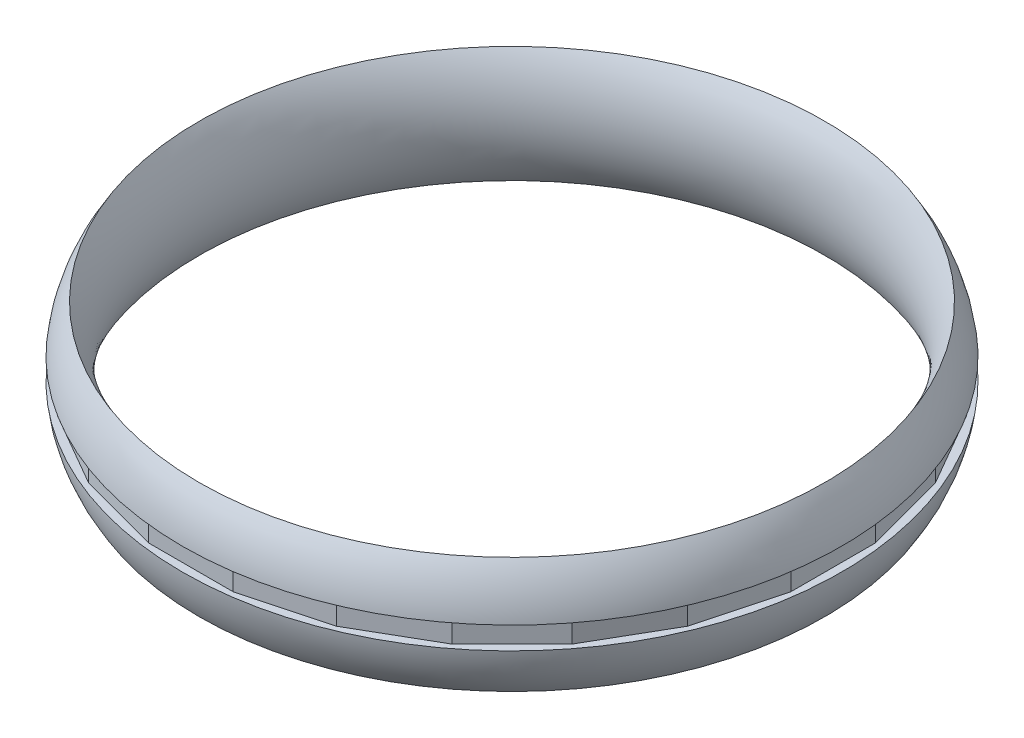
ISO-10303-21;
HEADER;
FILE_DESCRIPTION(('STEP AP214'),'2;1');
FILE_NAME('part.step','',(''),(''),'','','');
FILE_SCHEMA(('AUTOMOTIVE_DESIGN { 1 0 10303 214 1 1 1 1 }'));
ENDSEC;
DATA;
#1=APPLICATION_CONTEXT('core data for automotive mechanical design processes');
#2=APPLICATION_PROTOCOL_DEFINITION('international standard','automotive_design',2000,#1);
#3=PRODUCT_CONTEXT('',#1,'mechanical');
#4=PRODUCT('Part','Part','',(#3));
#5=PRODUCT_RELATED_PRODUCT_CATEGORY('part','',(#4));
#6=PRODUCT_DEFINITION_FORMATION('','',#4);
#7=PRODUCT_DEFINITION_CONTEXT('part definition',#1,'design');
#8=PRODUCT_DEFINITION('design','',#6,#7);
#9=PRODUCT_DEFINITION_SHAPE('','',#8);
#10=(LENGTH_UNIT() NAMED_UNIT(*) SI_UNIT(.MILLI.,.METRE.));
#11=(NAMED_UNIT(*) PLANE_ANGLE_UNIT() SI_UNIT($,.RADIAN.));
#12=(NAMED_UNIT(*) SI_UNIT($,.STERADIAN.) SOLID_ANGLE_UNIT());
#13=UNCERTAINTY_MEASURE_WITH_UNIT(LENGTH_MEASURE(1.E-05),#10,'distance_accuracy_value','');
#14=(GEOMETRIC_REPRESENTATION_CONTEXT(3) GLOBAL_UNCERTAINTY_ASSIGNED_CONTEXT((#13)) GLOBAL_UNIT_ASSIGNED_CONTEXT((#10,
#11,#12)) REPRESENTATION_CONTEXT('',''));
#15=CARTESIAN_POINT('',(0.,0.,0.));
#16=DIRECTION('',(0.,0.,1.));
#17=DIRECTION('',(1.,0.,0.));
#18=AXIS2_PLACEMENT_3D('',#15,#16,#17);
#19=CARTESIAN_POINT('',(0.,0.,0.));
#20=DIRECTION('',(0.,1.,0.));
#21=DIRECTION('',(0.,0.,1.));
#22=AXIS2_PLACEMENT_3D('',#19,#20,#21);
#23=TOROIDAL_SURFACE('',#22,50.,23.8537208837531);
#24=CARTESIAN_POINT('',(0.,-2.5,0.));
#25=DIRECTION('',(0.,-1.,0.));
#26=DIRECTION('',(0.,0.,-1.));
#27=AXIS2_PLACEMENT_3D('',#24,#25,#26);
#28=CIRCLE('',#27,73.7223523285529);
#29=CARTESIAN_POINT('',(0.,-2.5,-73.7223523285529));
#30=VERTEX_POINT('',#29);
#31=EDGE_CURVE('E12',#30,#30,#28,.F.);
#32=ORIENTED_EDGE('',*,*,#31,.F.);
#33=EDGE_LOOP('',(#32));
#34=FACE_BOUND('',#33,.T.);
#35=CARTESIAN_POINT('',(0.,-13.,0.));
#36=DIRECTION('',(0.,1.,0.));
#37=DIRECTION('',(0.,0.,1.));
#38=AXIS2_PLACEMENT_3D('',#35,#36,#37);
#39=CIRCLE('',#38,70.);
#40=CARTESIAN_POINT('',(0.,-13.,70.));
#41=VERTEX_POINT('',#40);
#42=EDGE_CURVE('E395',#41,#41,#39,.T.);
#43=ORIENTED_EDGE('',*,*,#42,.T.);
#44=EDGE_LOOP('',(#43));
#45=FACE_BOUND('',#44,.T.);
#46=ADVANCED_FACE('F44',(#34,#45),#23,.T.);
#47=CARTESIAN_POINT('',(0.,2.5,0.));
#48=DIRECTION('',(0.,1.,0.));
#49=DIRECTION('',(0.,0.,1.));
#50=AXIS2_PLACEMENT_3D('',#47,#48,#49);
#51=CIRCLE('',#50,73.7223523285529);
#52=CARTESIAN_POINT('',(0.,2.5,73.7223523285529));
#53=VERTEX_POINT('',#52);
#54=EDGE_CURVE('E52',#53,#53,#51,.F.);
#55=ORIENTED_EDGE('',*,*,#54,.F.);
#56=EDGE_LOOP('',(#55));
#57=FACE_BOUND('',#56,.T.);
#58=CARTESIAN_POINT('',(0.,13.,0.));
#59=DIRECTION('',(0.,1.,0.));
#60=DIRECTION('',(0.,0.,1.));
#61=AXIS2_PLACEMENT_3D('',#58,#59,#60);
#62=CIRCLE('',#61,70.);
#63=CARTESIAN_POINT('',(0.,13.,70.));
#64=VERTEX_POINT('',#63);
#65=EDGE_CURVE('E391',#64,#64,#62,.T.);
#66=ORIENTED_EDGE('',*,*,#65,.F.);
#67=EDGE_LOOP('',(#66));
#68=FACE_BOUND('',#67,.T.);
#69=ADVANCED_FACE('F46',(#57,#68),#23,.T.);
#70=CARTESIAN_POINT('',(0.,0.,0.));
#71=DIRECTION('',(0.,1.,0.));
#72=DIRECTION('',(0.,0.,1.));
#73=AXIS2_PLACEMENT_3D('',#70,#71,#72);
#74=TOROIDAL_SURFACE('',#73,90.,23.8537208837531);
#75=ORIENTED_EDGE('',*,*,#65,.T.);
#76=EDGE_LOOP('',(#75));
#77=FACE_BOUND('',#76,.T.);
#78=ORIENTED_EDGE('',*,*,#42,.F.);
#79=EDGE_LOOP('',(#78));
#80=FACE_BOUND('',#79,.T.);
#81=ADVANCED_FACE('F402',(#77,#80),#74,.T.);
#82=CARTESIAN_POINT('',(-71.8537208837531,2.5,-73.8537208837531));
#83=DIRECTION('',(1.,0.,0.));
#84=DIRECTION('',(0.,0.,-1.));
#85=AXIS2_PLACEMENT_3D('',#82,#83,#84);
#86=PLANE('',#85);
#87=DIRECTION('',(0.,0.,1.));
#88=VECTOR('',#87,1.);
#89=CARTESIAN_POINT('',(-71.8537208837531,-2.5,-73.8537208837531));
#90=LINE('',#89,#88);
#91=CARTESIAN_POINT('',(-71.8537208837531,-2.5,-9.4597218152932));
#92=VERTEX_POINT('',#91);
#93=CARTESIAN_POINT('',(-71.853720883753,-2.5,9.45972181529429));
#94=VERTEX_POINT('',#93);
#95=EDGE_CURVE('E388',#92,#94,#90,.T.);
#96=ORIENTED_EDGE('',*,*,#95,.T.);
#97=DIRECTION('',(0.,1.,0.));
#98=VECTOR('',#97,1.);
#99=CARTESIAN_POINT('',(-71.8537208837531,2.5,9.45972181529428));
#100=LINE('',#99,#98);
#101=CARTESIAN_POINT('',(-71.853720883753,2.5,9.45972181529429));
#102=VERTEX_POINT('',#101);
#103=EDGE_CURVE('E227',#94,#102,#100,.T.);
#104=ORIENTED_EDGE('',*,*,#103,.T.);
#105=DIRECTION('',(0.,0.,1.));
#106=VECTOR('',#105,1.);
#107=CARTESIAN_POINT('',(-71.8537208837531,2.5,-73.8537208837531));
#108=LINE('',#107,#106);
#109=CARTESIAN_POINT('',(-71.8537208837531,2.5,-9.4597218152932));
#110=VERTEX_POINT('',#109);
#111=EDGE_CURVE('E386',#110,#102,#108,.T.);
#112=ORIENTED_EDGE('',*,*,#111,.F.);
#113=DIRECTION('',(0.,1.,0.));
#114=VECTOR('',#113,1.);
#115=CARTESIAN_POINT('',(-71.8537208837531,2.5,-9.45972181529324));
#116=LINE('',#115,#114);
#117=EDGE_CURVE('E225',#92,#110,#116,.T.);
#118=ORIENTED_EDGE('',*,*,#117,.F.);
#119=EDGE_LOOP('',(#96,#104,#112,#118));
#120=FACE_BOUND('',#119,.T.);
#121=ADVANCED_FACE('F407',(#120),#86,.F.);
#122=CARTESIAN_POINT('',(-75.8537208837531,-2.5,-73.8537208837531));
#123=DIRECTION('',(0.,-1.,0.));
#124=DIRECTION('',(0.,0.,-1.));
#125=AXIS2_PLACEMENT_3D('',#122,#123,#124);
#126=PLANE('',#125);
#127=ORIENTED_EDGE('',*,*,#31,.T.);
#128=EDGE_LOOP('',(#127));
#129=FACE_BOUND('',#128,.T.);
#130=DIRECTION('',(0.258819045102521,0.,0.965925826289068));
#131=VECTOR('',#130,1.);
#132=CARTESIAN_POINT('',(-92.8072561301613,-2.5,-68.7399363224865));
#133=LINE('',#132,#131);
#134=CARTESIAN_POINT('',(-66.9570085494132,-2.5,27.7345010370994));
#135=VERTEX_POINT('',#134);
#136=EDGE_CURVE('E384',#94,#135,#133,.T.);
#137=ORIENTED_EDGE('',*,*,#136,.F.);
#138=ORIENTED_EDGE('',*,*,#95,.F.);
#139=DIRECTION('',(-0.258819045102508,0.,0.965925826289072));
#140=VECTOR('',#139,1.);
#141=CARTESIAN_POINT('',(-45.9946732784378,-2.5,-105.967001313677));
#142=LINE('',#141,#140);
#143=CARTESIAN_POINT('',(-66.9570085494139,-2.5,-27.7345010370975));
#144=VERTEX_POINT('',#143);
#145=EDGE_CURVE('E59',#144,#92,#142,.T.);
#146=ORIENTED_EDGE('',*,*,#145,.F.);
#147=DIRECTION('',(-0.499999999999989,0.,0.866025403784445));
#148=VECTOR('',#147,1.);
#149=CARTESIAN_POINT('',(-11.7841181961624,-2.5,-123.296750329359));
#150=LINE('',#149,#148);
#151=CARTESIAN_POINT('',(-57.4972867341203,-2.5,-44.1192198466541));
#152=VERTEX_POINT('',#151);
#153=EDGE_CURVE('E218',#152,#144,#150,.T.);
#154=ORIENTED_EDGE('',*,*,#153,.F.);
#155=DIRECTION('',(-0.707106781186539,0.,0.707106781186556));
#156=VECTOR('',#155,1.);
#157=CARTESIAN_POINT('',(23.0454675933643,-2.5,-124.661974174141));
#158=LINE('',#157,#156);
#159=CARTESIAN_POINT('',(-44.1192198466554,-2.5,-57.4972867341193));
#160=VERTEX_POINT('',#159);
#161=EDGE_CURVE('E237',#160,#152,#158,.T.);
#162=ORIENTED_EDGE('',*,*,#161,.F.);
#163=DIRECTION('',(-0.866025403784433,0.,0.50000000000001));
#164=VECTOR('',#163,1.);
#165=CARTESIAN_POINT('',(51.443029445605,-2.5,-112.670177087373));
#166=LINE('',#165,#164);
#167=CARTESIAN_POINT('',(-27.7345010370992,-2.5,-66.9570085494132));
#168=VERTEX_POINT('',#167);
#169=EDGE_CURVE('E245',#168,#160,#166,.T.);
#170=ORIENTED_EDGE('',*,*,#169,.F.);
#171=DIRECTION('',(-0.965925826289066,0.,0.258819045102531));
#172=VECTOR('',#171,1.);
#173=CARTESIAN_POINT('',(68.7727784612861,-2.5,-92.8160561547313));
#174=LINE('',#173,#172);
#175=CARTESIAN_POINT('',(-9.45972181529448,-2.5,-71.853720883753));
#176=VERTEX_POINT('',#175);
#177=EDGE_CURVE('E249',#176,#168,#174,.T.);
#178=ORIENTED_EDGE('',*,*,#177,.F.);
#179=DIRECTION('',(-1.,0.,0.));
#180=VECTOR('',#179,1.);
#181=CARTESIAN_POINT('',(73.8537208837532,-2.5,-71.8537208837539));
#182=LINE('',#181,#180);
#183=CARTESIAN_POINT('',(9.45972181529287,-2.5,-71.8537208837532));
#184=VERTEX_POINT('',#183);
#185=EDGE_CURVE('E257',#184,#176,#182,.T.);
#186=ORIENTED_EDGE('',*,*,#185,.F.);
#187=DIRECTION('',(-0.965925826289071,0.,-0.258819045102511));
#188=VECTOR('',#187,1.);
#189=CARTESIAN_POINT('',(105.967001313678,-2.5,-45.9946732784374));
#190=LINE('',#189,#188);
#191=CARTESIAN_POINT('',(27.7345010370977,-2.5,-66.9570085494138));
#192=VERTEX_POINT('',#191);
#193=EDGE_CURVE('E267',#192,#184,#190,.T.);
#194=ORIENTED_EDGE('',*,*,#193,.F.);
#195=DIRECTION('',(-0.866025403784443,0.,-0.499999999999992));
#196=VECTOR('',#195,1.);
#197=CARTESIAN_POINT('',(123.296750329359,-2.5,-11.7841181961619));
#198=LINE('',#197,#196);
#199=CARTESIAN_POINT('',(44.1192198466542,-2.5,-57.4972867341202));
#200=VERTEX_POINT('',#199);
#201=EDGE_CURVE('E275',#200,#192,#198,.T.);
#202=ORIENTED_EDGE('',*,*,#201,.F.);
#203=DIRECTION('',(-0.707106781186554,0.,-0.707106781186541));
#204=VECTOR('',#203,1.);
#205=CARTESIAN_POINT('',(124.661974174141,-2.5,23.0454675933648));
#206=LINE('',#205,#204);
#207=CARTESIAN_POINT('',(57.4972867341194,-2.5,-44.1192198466553));
#208=VERTEX_POINT('',#207);
#209=EDGE_CURVE('E279',#208,#200,#206,.T.);
#210=ORIENTED_EDGE('',*,*,#209,.F.);
#211=DIRECTION('',(-0.500000000000007,0.,-0.866025403784434));
#212=VECTOR('',#211,1.);
#213=CARTESIAN_POINT('',(112.670177087373,-2.5,51.4430294456053));
#214=LINE('',#213,#212);
#215=CARTESIAN_POINT('',(66.9570085494133,-2.5,-27.7345010370989));
#216=VERTEX_POINT('',#215);
#217=EDGE_CURVE('E287',#216,#208,#214,.T.);
#218=ORIENTED_EDGE('',*,*,#217,.F.);
#219=DIRECTION('',(-0.258819045102528,0.,-0.965925826289066));
#220=VECTOR('',#219,1.);
#221=CARTESIAN_POINT('',(92.816056154731,-2.5,68.7727784612862));
#222=LINE('',#221,#220);
#223=CARTESIAN_POINT('',(71.8537208837531,-2.5,-9.45972181529398));
#224=VERTEX_POINT('',#223);
#225=EDGE_CURVE('E297',#224,#216,#222,.T.);
#226=ORIENTED_EDGE('',*,*,#225,.F.);
#227=DIRECTION('',(0.,0.,-1.));
#228=VECTOR('',#227,1.);
#229=CARTESIAN_POINT('',(71.8537208837531,-2.5,73.8537208837531));
#230=LINE('',#229,#228);
#231=CARTESIAN_POINT('',(71.8537208837532,-2.5,9.45972181529335));
#232=VERTEX_POINT('',#231);
#233=EDGE_CURVE('E305',#232,#224,#230,.T.);
#234=ORIENTED_EDGE('',*,*,#233,.F.);
#235=DIRECTION('',(0.258819045102515,0.,-0.96592582628907));
#236=VECTOR('',#235,1.);
#237=CARTESIAN_POINT('',(46.0034733030062,-2.5,105.934159174878));
#238=LINE('',#237,#236);
#239=CARTESIAN_POINT('',(66.9570085494137,-2.5,27.734501037098));
#240=VERTEX_POINT('',#239);
#241=EDGE_CURVE('E309',#240,#232,#238,.T.);
#242=ORIENTED_EDGE('',*,*,#241,.F.);
#243=DIRECTION('',(0.499999999999995,0.,-0.866025403784442));
#244=VECTOR('',#243,1.);
#245=CARTESIAN_POINT('',(11.8169603349614,-2.5,123.239866076328));
#246=LINE('',#245,#244);
#247=CARTESIAN_POINT('',(57.49728673412,-2.5,44.1192198466545));
#248=VERTEX_POINT('',#247);
#249=EDGE_CURVE('E317',#248,#240,#246,.T.);
#250=ORIENTED_EDGE('',*,*,#249,.F.);
#251=DIRECTION('',(0.707106781186544,0.,-0.707106781186551));
#252=VECTOR('',#251,1.);
#253=CARTESIAN_POINT('',(-22.9797833157651,-2.5,124.59628989654));
#254=LINE('',#253,#252);
#255=CARTESIAN_POINT('',(44.1192198466551,-2.5,57.4972867341196));
#256=VERTEX_POINT('',#255);
#257=EDGE_CURVE('E327',#256,#248,#254,.T.);
#258=ORIENTED_EDGE('',*,*,#257,.F.);
#259=DIRECTION('',(0.866025403784436,0.,-0.500000000000004));
#260=VECTOR('',#259,1.);
#261=CARTESIAN_POINT('',(-51.3445030292054,-2.5,112.613292834342));
#262=LINE('',#261,#260);
#263=CARTESIAN_POINT('',(27.7345010370987,-2.5,66.9570085494134));
#264=VERTEX_POINT('',#263);
#265=EDGE_CURVE('E335',#264,#256,#262,.T.);
#266=ORIENTED_EDGE('',*,*,#265,.F.);
#267=DIRECTION('',(0.965925826289067,0.,-0.258819045102525));
#268=VECTOR('',#267,1.);
#269=CARTESIAN_POINT('',(-68.6502099306554,-2.5,92.7832140159307));
#270=LINE('',#269,#268);
#271=CARTESIAN_POINT('',(9.45972181529397,-2.5,71.8537208837531));
#272=VERTEX_POINT('',#271);
#273=EDGE_CURVE('E339',#272,#264,#270,.T.);
#274=ORIENTED_EDGE('',*,*,#273,.F.);
#275=DIRECTION('',(1.,0.,0.));
#276=VECTOR('',#275,1.);
#277=CARTESIAN_POINT('',(-73.7223523285529,-2.5,71.8537208837534));
#278=LINE('',#277,#276);
#279=CARTESIAN_POINT('',(-9.45972181529338,-2.5,71.8537208837532));
#280=VERTEX_POINT('',#279);
#281=EDGE_CURVE('E347',#280,#272,#278,.T.);
#282=ORIENTED_EDGE('',*,*,#281,.F.);
#283=DIRECTION('',(0.965925826289069,0.,0.258819045102518));
#284=VECTOR('',#283,1.);
#285=CARTESIAN_POINT('',(-105.844432783047,-2.5,46.0275154172366));
#286=LINE('',#285,#284);
#287=CARTESIAN_POINT('',(-27.7345010370982,-2.5,66.9570085494136));
#288=VERTEX_POINT('',#287);
#289=EDGE_CURVE('E357',#288,#280,#286,.T.);
#290=ORIENTED_EDGE('',*,*,#289,.F.);
#291=DIRECTION('',(0.86602540378444,0.,0.499999999999998));
#292=VECTOR('',#291,1.);
#293=CARTESIAN_POINT('',(-123.198223912959,-2.5,11.8410024491918));
#294=LINE('',#293,#292);
#295=CARTESIAN_POINT('',(-44.1192198466548,-2.5,57.4972867341198));
#296=VERTEX_POINT('',#295);
#297=EDGE_CURVE('E365',#296,#288,#294,.T.);
#298=ORIENTED_EDGE('',*,*,#297,.F.);
#299=DIRECTION('',(0.707106781186549,0.,0.707106781186546));
#300=VECTOR('',#299,1.);
#301=CARTESIAN_POINT('',(-124.59628989654,-2.5,-22.9797833157655));
#302=LINE('',#301,#300);
#303=CARTESIAN_POINT('',(-57.4972867341197,-2.5,44.1192198466549));
#304=VERTEX_POINT('',#303);
#305=EDGE_CURVE('E369',#304,#296,#302,.T.);
#306=ORIENTED_EDGE('',*,*,#305,.F.);
#307=DIRECTION('',(0.500000000000001,0.,0.866025403784438));
#308=VECTOR('',#307,1.);
#309=CARTESIAN_POINT('',(-112.637334948573,-2.5,-51.386145192575));
#310=LINE('',#309,#308);
#311=EDGE_CURVE('E377',#135,#304,#310,.T.);
#312=ORIENTED_EDGE('',*,*,#311,.F.);
#313=EDGE_LOOP('',(#137,#138,#146,#154,#162,#170,#178,#186,#194,#202,#210,#218,#226,#234,#242,
#250,#258,#266,#274,#282,#290,#298,#306,#312));
#314=FACE_BOUND('',#313,.T.);
#315=ADVANCED_FACE('F417',(#129,#314),#126,.F.);
#316=CARTESIAN_POINT('',(-75.8537208837531,2.5,-73.8537208837531));
#317=DIRECTION('',(0.,1.,0.));
#318=DIRECTION('',(0.,0.,1.));
#319=AXIS2_PLACEMENT_3D('',#316,#317,#318);
#320=PLANE('',#319);
#321=DIRECTION('',(-0.258819045102508,0.,0.965925826289072));
#322=VECTOR('',#321,1.);
#323=CARTESIAN_POINT('',(-45.9946732784378,2.5,-105.967001313677));
#324=LINE('',#323,#322);
#325=CARTESIAN_POINT('',(-66.9570085494139,2.5,-27.7345010370975));
#326=VERTEX_POINT('',#325);
#327=EDGE_CURVE('E213',#326,#110,#324,.T.);
#328=ORIENTED_EDGE('',*,*,#327,.T.);
#329=ORIENTED_EDGE('',*,*,#111,.T.);
#330=DIRECTION('',(0.258819045102521,0.,0.965925826289068));
#331=VECTOR('',#330,1.);
#332=CARTESIAN_POINT('',(-92.8072561301613,2.5,-68.7399363224865));
#333=LINE('',#332,#331);
#334=CARTESIAN_POINT('',(-66.9570085494132,2.5,27.7345010370994));
#335=VERTEX_POINT('',#334);
#336=EDGE_CURVE('E383',#102,#335,#333,.T.);
#337=ORIENTED_EDGE('',*,*,#336,.T.);
#338=DIRECTION('',(0.500000000000001,0.,0.866025403784438));
#339=VECTOR('',#338,1.);
#340=CARTESIAN_POINT('',(-112.637334948573,2.5,-51.386145192575));
#341=LINE('',#340,#339);
#342=CARTESIAN_POINT('',(-57.4972867341197,2.5,44.1192198466549));
#343=VERTEX_POINT('',#342);
#344=EDGE_CURVE('E376',#335,#343,#341,.T.);
#345=ORIENTED_EDGE('',*,*,#344,.T.);
#346=DIRECTION('',(0.707106781186549,0.,0.707106781186546));
#347=VECTOR('',#346,1.);
#348=CARTESIAN_POINT('',(-124.59628989654,2.5,-22.9797833157655));
#349=LINE('',#348,#347);
#350=CARTESIAN_POINT('',(-44.1192198466548,2.5,57.4972867341198));
#351=VERTEX_POINT('',#350);
#352=EDGE_CURVE('E367',#343,#351,#349,.T.);
#353=ORIENTED_EDGE('',*,*,#352,.T.);
#354=DIRECTION('',(0.86602540378444,0.,0.499999999999998));
#355=VECTOR('',#354,1.);
#356=CARTESIAN_POINT('',(-123.198223912959,2.5,11.8410024491918));
#357=LINE('',#356,#355);
#358=CARTESIAN_POINT('',(-27.7345010370982,2.5,66.9570085494136));
#359=VERTEX_POINT('',#358);
#360=EDGE_CURVE('E364',#351,#359,#357,.T.);
#361=ORIENTED_EDGE('',*,*,#360,.T.);
#362=DIRECTION('',(0.965925826289069,0.,0.258819045102518));
#363=VECTOR('',#362,1.);
#364=CARTESIAN_POINT('',(-105.844432783047,2.5,46.0275154172366));
#365=LINE('',#364,#363);
#366=CARTESIAN_POINT('',(-9.45972181529338,2.5,71.8537208837532));
#367=VERTEX_POINT('',#366);
#368=EDGE_CURVE('E356',#359,#367,#365,.T.);
#369=ORIENTED_EDGE('',*,*,#368,.T.);
#370=DIRECTION('',(1.,0.,0.));
#371=VECTOR('',#370,1.);
#372=CARTESIAN_POINT('',(-73.7223523285529,2.5,71.8537208837534));
#373=LINE('',#372,#371);
#374=CARTESIAN_POINT('',(9.45972181529397,2.5,71.8537208837531));
#375=VERTEX_POINT('',#374);
#376=EDGE_CURVE('E346',#367,#375,#373,.T.);
#377=ORIENTED_EDGE('',*,*,#376,.T.);
#378=DIRECTION('',(0.965925826289067,0.,-0.258819045102525));
#379=VECTOR('',#378,1.);
#380=CARTESIAN_POINT('',(-68.6502099306554,2.5,92.7832140159307));
#381=LINE('',#380,#379);
#382=CARTESIAN_POINT('',(27.7345010370987,2.5,66.9570085494134));
#383=VERTEX_POINT('',#382);
#384=EDGE_CURVE('E337',#375,#383,#381,.T.);
#385=ORIENTED_EDGE('',*,*,#384,.T.);
#386=DIRECTION('',(0.866025403784436,0.,-0.500000000000004));
#387=VECTOR('',#386,1.);
#388=CARTESIAN_POINT('',(-51.3445030292054,2.5,112.613292834342));
#389=LINE('',#388,#387);
#390=CARTESIAN_POINT('',(44.1192198466551,2.5,57.4972867341196));
#391=VERTEX_POINT('',#390);
#392=EDGE_CURVE('E334',#383,#391,#389,.T.);
#393=ORIENTED_EDGE('',*,*,#392,.T.);
#394=DIRECTION('',(0.707106781186544,0.,-0.707106781186551));
#395=VECTOR('',#394,1.);
#396=CARTESIAN_POINT('',(-22.9797833157651,2.5,124.59628989654));
#397=LINE('',#396,#395);
#398=CARTESIAN_POINT('',(57.49728673412,2.5,44.1192198466545));
#399=VERTEX_POINT('',#398);
#400=EDGE_CURVE('E326',#391,#399,#397,.T.);
#401=ORIENTED_EDGE('',*,*,#400,.T.);
#402=DIRECTION('',(0.499999999999995,0.,-0.866025403784442));
#403=VECTOR('',#402,1.);
#404=CARTESIAN_POINT('',(11.8169603349614,2.5,123.239866076328));
#405=LINE('',#404,#403);
#406=CARTESIAN_POINT('',(66.9570085494137,2.5,27.734501037098));
#407=VERTEX_POINT('',#406);
#408=EDGE_CURVE('E316',#399,#407,#405,.T.);
#409=ORIENTED_EDGE('',*,*,#408,.T.);
#410=DIRECTION('',(0.258819045102515,0.,-0.96592582628907));
#411=VECTOR('',#410,1.);
#412=CARTESIAN_POINT('',(46.0034733030062,2.5,105.934159174878));
#413=LINE('',#412,#411);
#414=CARTESIAN_POINT('',(71.8537208837532,2.5,9.45972181529335));
#415=VERTEX_POINT('',#414);
#416=EDGE_CURVE('E307',#407,#415,#413,.T.);
#417=ORIENTED_EDGE('',*,*,#416,.T.);
#418=DIRECTION('',(0.,0.,-1.));
#419=VECTOR('',#418,1.);
#420=CARTESIAN_POINT('',(71.8537208837531,2.5,73.8537208837531));
#421=LINE('',#420,#419);
#422=CARTESIAN_POINT('',(71.8537208837531,2.5,-9.45972181529398));
#423=VERTEX_POINT('',#422);
#424=EDGE_CURVE('E304',#415,#423,#421,.T.);
#425=ORIENTED_EDGE('',*,*,#424,.T.);
#426=DIRECTION('',(-0.258819045102528,0.,-0.965925826289066));
#427=VECTOR('',#426,1.);
#428=CARTESIAN_POINT('',(92.816056154731,2.5,68.7727784612862));
#429=LINE('',#428,#427);
#430=CARTESIAN_POINT('',(66.9570085494133,2.5,-27.7345010370989));
#431=VERTEX_POINT('',#430);
#432=EDGE_CURVE('E296',#423,#431,#429,.T.);
#433=ORIENTED_EDGE('',*,*,#432,.T.);
#434=DIRECTION('',(-0.500000000000007,0.,-0.866025403784434));
#435=VECTOR('',#434,1.);
#436=CARTESIAN_POINT('',(112.670177087373,2.5,51.4430294456053));
#437=LINE('',#436,#435);
#438=CARTESIAN_POINT('',(57.4972867341194,2.5,-44.1192198466553));
#439=VERTEX_POINT('',#438);
#440=EDGE_CURVE('E286',#431,#439,#437,.T.);
#441=ORIENTED_EDGE('',*,*,#440,.T.);
#442=DIRECTION('',(-0.707106781186554,0.,-0.707106781186541));
#443=VECTOR('',#442,1.);
#444=CARTESIAN_POINT('',(124.661974174141,2.5,23.0454675933648));
#445=LINE('',#444,#443);
#446=CARTESIAN_POINT('',(44.1192198466542,2.5,-57.4972867341202));
#447=VERTEX_POINT('',#446);
#448=EDGE_CURVE('E277',#439,#447,#445,.T.);
#449=ORIENTED_EDGE('',*,*,#448,.T.);
#450=DIRECTION('',(-0.866025403784443,0.,-0.499999999999992));
#451=VECTOR('',#450,1.);
#452=CARTESIAN_POINT('',(123.296750329359,2.5,-11.7841181961619));
#453=LINE('',#452,#451);
#454=CARTESIAN_POINT('',(27.7345010370977,2.5,-66.9570085494138));
#455=VERTEX_POINT('',#454);
#456=EDGE_CURVE('E274',#447,#455,#453,.T.);
#457=ORIENTED_EDGE('',*,*,#456,.T.);
#458=DIRECTION('',(-0.965925826289071,0.,-0.258819045102511));
#459=VECTOR('',#458,1.);
#460=CARTESIAN_POINT('',(105.967001313678,2.5,-45.9946732784374));
#461=LINE('',#460,#459);
#462=CARTESIAN_POINT('',(9.45972181529287,2.5,-71.8537208837532));
#463=VERTEX_POINT('',#462);
#464=EDGE_CURVE('E266',#455,#463,#461,.T.);
#465=ORIENTED_EDGE('',*,*,#464,.T.);
#466=DIRECTION('',(-1.,0.,0.));
#467=VECTOR('',#466,1.);
#468=CARTESIAN_POINT('',(73.8537208837532,2.5,-71.8537208837539));
#469=LINE('',#468,#467);
#470=CARTESIAN_POINT('',(-9.45972181529448,2.5,-71.853720883753));
#471=VERTEX_POINT('',#470);
#472=EDGE_CURVE('E256',#463,#471,#469,.T.);
#473=ORIENTED_EDGE('',*,*,#472,.T.);
#474=DIRECTION('',(-0.965925826289066,0.,0.258819045102531));
#475=VECTOR('',#474,1.);
#476=CARTESIAN_POINT('',(68.7727784612861,2.5,-92.8160561547313));
#477=LINE('',#476,#475);
#478=CARTESIAN_POINT('',(-27.7345010370992,2.5,-66.9570085494132));
#479=VERTEX_POINT('',#478);
#480=EDGE_CURVE('E247',#471,#479,#477,.T.);
#481=ORIENTED_EDGE('',*,*,#480,.T.);
#482=DIRECTION('',(-0.866025403784433,0.,0.50000000000001));
#483=VECTOR('',#482,1.);
#484=CARTESIAN_POINT('',(51.443029445605,2.5,-112.670177087373));
#485=LINE('',#484,#483);
#486=CARTESIAN_POINT('',(-44.1192198466554,2.5,-57.4972867341193));
#487=VERTEX_POINT('',#486);
#488=EDGE_CURVE('E244',#479,#487,#485,.T.);
#489=ORIENTED_EDGE('',*,*,#488,.T.);
#490=DIRECTION('',(-0.707106781186539,0.,0.707106781186556));
#491=VECTOR('',#490,1.);
#492=CARTESIAN_POINT('',(23.0454675933643,2.5,-124.661974174141));
#493=LINE('',#492,#491);
#494=CARTESIAN_POINT('',(-57.4972867341203,2.5,-44.1192198466541));
#495=VERTEX_POINT('',#494);
#496=EDGE_CURVE('E215',#487,#495,#493,.T.);
#497=ORIENTED_EDGE('',*,*,#496,.T.);
#498=DIRECTION('',(-0.499999999999989,0.,0.866025403784445));
#499=VECTOR('',#498,1.);
#500=CARTESIAN_POINT('',(-11.7841181961624,2.5,-123.296750329359));
#501=LINE('',#500,#499);
#502=EDGE_CURVE('E207',#495,#326,#501,.T.);
#503=ORIENTED_EDGE('',*,*,#502,.T.);
#504=EDGE_LOOP('',(#328,#329,#337,#345,#353,#361,#369,#377,#385,#393,#401,#409,#417,#425,#433,
#441,#449,#457,#465,#473,#481,#489,#497,#503));
#505=FACE_BOUND('',#504,.T.);
#506=ORIENTED_EDGE('',*,*,#54,.T.);
#507=EDGE_LOOP('',(#506));
#508=FACE_BOUND('',#507,.T.);
#509=ADVANCED_FACE('F209',(#505,#508),#320,.F.);
#510=CARTESIAN_POINT('',(-92.8072561301613,2.5,-68.7399363224865));
#511=DIRECTION('',(0.965925826289068,0.,-0.258819045102521));
#512=DIRECTION('',(-0.258819045102521,0.,-0.965925826289068));
#513=AXIS2_PLACEMENT_3D('',#510,#511,#512);
#514=PLANE('',#513);
#515=DIRECTION('',(0.,1.,0.));
#516=VECTOR('',#515,1.);
#517=CARTESIAN_POINT('',(-66.9570085494131,2.5,27.7345010370994));
#518=LINE('',#517,#516);
#519=EDGE_CURVE('E67',#135,#335,#518,.T.);
#520=ORIENTED_EDGE('',*,*,#519,.T.);
#521=ORIENTED_EDGE('',*,*,#336,.F.);
#522=ORIENTED_EDGE('',*,*,#103,.F.);
#523=ORIENTED_EDGE('',*,*,#136,.T.);
#524=EDGE_LOOP('',(#520,#521,#522,#523));
#525=FACE_BOUND('',#524,.T.);
#526=ADVANCED_FACE('F426',(#525),#514,.F.);
#527=CARTESIAN_POINT('',(-112.637334948573,2.5,-51.386145192575));
#528=DIRECTION('',(0.866025403784438,0.,-0.500000000000001));
#529=DIRECTION('',(-0.500000000000001,0.,-0.866025403784438));
#530=AXIS2_PLACEMENT_3D('',#527,#528,#529);
#531=PLANE('',#530);
#532=ORIENTED_EDGE('',*,*,#519,.F.);
#533=ORIENTED_EDGE('',*,*,#311,.T.);
#534=DIRECTION('',(0.,1.,0.));
#535=VECTOR('',#534,1.);
#536=CARTESIAN_POINT('',(-57.4972867341197,2.5,44.1192198466549));
#537=LINE('',#536,#535);
#538=EDGE_CURVE('E372',#304,#343,#537,.T.);
#539=ORIENTED_EDGE('',*,*,#538,.T.);
#540=ORIENTED_EDGE('',*,*,#344,.F.);
#541=EDGE_LOOP('',(#532,#533,#539,#540));
#542=FACE_BOUND('',#541,.T.);
#543=ADVANCED_FACE('F428',(#542),#531,.F.);
#544=CARTESIAN_POINT('',(105.967001313678,2.5,-45.9946732784374));
#545=DIRECTION('',(-0.258819045102511,0.,0.965925826289071));
#546=DIRECTION('',(0.965925826289071,0.,0.258819045102511));
#547=AXIS2_PLACEMENT_3D('',#544,#545,#546);
#548=PLANE('',#547);
#549=DIRECTION('',(0.,1.,0.));
#550=VECTOR('',#549,1.);
#551=CARTESIAN_POINT('',(9.45972181529298,2.5,-71.8537208837532));
#552=LINE('',#551,#550);
#553=EDGE_CURVE('E263',#184,#463,#552,.T.);
#554=ORIENTED_EDGE('',*,*,#553,.T.);
#555=ORIENTED_EDGE('',*,*,#464,.F.);
#556=DIRECTION('',(0.,1.,0.));
#557=VECTOR('',#556,1.);
#558=CARTESIAN_POINT('',(27.7345010370977,2.5,-66.9570085494138));
#559=LINE('',#558,#557);
#560=EDGE_CURVE('E270',#192,#455,#559,.T.);
#561=ORIENTED_EDGE('',*,*,#560,.F.);
#562=ORIENTED_EDGE('',*,*,#193,.T.);
#563=EDGE_LOOP('',(#554,#555,#561,#562));
#564=FACE_BOUND('',#563,.T.);
#565=ADVANCED_FACE('F496',(#564),#548,.F.);
#566=CARTESIAN_POINT('',(-22.9797833157651,2.5,124.59628989654));
#567=DIRECTION('',(-0.707106781186551,0.,-0.707106781186544));
#568=DIRECTION('',(-0.707106781186544,0.,0.707106781186551));
#569=AXIS2_PLACEMENT_3D('',#566,#567,#568);
#570=PLANE('',#569);
#571=DIRECTION('',(0.,1.,0.));
#572=VECTOR('',#571,1.);
#573=CARTESIAN_POINT('',(57.4972867341201,2.5,44.1192198466544));
#574=LINE('',#573,#572);
#575=EDGE_CURVE('E323',#248,#399,#574,.T.);
#576=ORIENTED_EDGE('',*,*,#575,.T.);
#577=ORIENTED_EDGE('',*,*,#400,.F.);
#578=DIRECTION('',(0.,1.,0.));
#579=VECTOR('',#578,1.);
#580=CARTESIAN_POINT('',(44.1192198466551,2.5,57.4972867341196));
#581=LINE('',#580,#579);
#582=EDGE_CURVE('E330',#256,#391,#581,.T.);
#583=ORIENTED_EDGE('',*,*,#582,.F.);
#584=ORIENTED_EDGE('',*,*,#257,.T.);
#585=EDGE_LOOP('',(#576,#577,#583,#584));
#586=FACE_BOUND('',#585,.T.);
#587=ADVANCED_FACE('F460',(#586),#570,.F.);
#588=CARTESIAN_POINT('',(-105.844432783047,2.5,46.0275154172366));
#589=DIRECTION('',(0.258819045102518,0.,-0.965925826289069));
#590=DIRECTION('',(-0.965925826289069,0.,-0.258819045102518));
#591=AXIS2_PLACEMENT_3D('',#588,#589,#590);
#592=PLANE('',#591);
#593=DIRECTION('',(0.,1.,0.));
#594=VECTOR('',#593,1.);
#595=CARTESIAN_POINT('',(-9.4597218152935,2.5,71.8537208837532));
#596=LINE('',#595,#594);
#597=EDGE_CURVE('E353',#280,#367,#596,.T.);
#598=ORIENTED_EDGE('',*,*,#597,.T.);
#599=ORIENTED_EDGE('',*,*,#368,.F.);
#600=DIRECTION('',(0.,1.,0.));
#601=VECTOR('',#600,1.);
#602=CARTESIAN_POINT('',(-27.7345010370982,2.5,66.9570085494136));
#603=LINE('',#602,#601);
#604=EDGE_CURVE('E360',#288,#359,#603,.T.);
#605=ORIENTED_EDGE('',*,*,#604,.F.);
#606=ORIENTED_EDGE('',*,*,#289,.T.);
#607=EDGE_LOOP('',(#598,#599,#605,#606));
#608=FACE_BOUND('',#607,.T.);
#609=ADVANCED_FACE('F442',(#608),#592,.F.);
#610=CARTESIAN_POINT('',(-124.59628989654,2.5,-22.9797833157655));
#611=DIRECTION('',(0.707106781186546,0.,-0.707106781186549));
#612=DIRECTION('',(-0.707106781186549,0.,-0.707106781186546));
#613=AXIS2_PLACEMENT_3D('',#610,#611,#612);
#614=PLANE('',#613);
#615=DIRECTION('',(0.,1.,0.));
#616=VECTOR('',#615,1.);
#617=CARTESIAN_POINT('',(-44.1192198466547,2.5,57.4972867341198));
#618=LINE('',#617,#616);
#619=EDGE_CURVE('E379',#296,#351,#618,.T.);
#620=ORIENTED_EDGE('',*,*,#619,.T.);
#621=ORIENTED_EDGE('',*,*,#352,.F.);
#622=ORIENTED_EDGE('',*,*,#538,.F.);
#623=ORIENTED_EDGE('',*,*,#305,.T.);
#624=EDGE_LOOP('',(#620,#621,#622,#623));
#625=FACE_BOUND('',#624,.T.);
#626=ADVANCED_FACE('F433',(#625),#614,.F.);
#627=CARTESIAN_POINT('',(-123.198223912959,2.5,11.8410024491918));
#628=DIRECTION('',(0.499999999999998,0.,-0.86602540378444));
#629=DIRECTION('',(-0.86602540378444,0.,-0.499999999999998));
#630=AXIS2_PLACEMENT_3D('',#627,#628,#629);
#631=PLANE('',#630);
#632=ORIENTED_EDGE('',*,*,#297,.T.);
#633=ORIENTED_EDGE('',*,*,#604,.T.);
#634=ORIENTED_EDGE('',*,*,#360,.F.);
#635=ORIENTED_EDGE('',*,*,#619,.F.);
#636=EDGE_LOOP('',(#632,#633,#634,#635));
#637=FACE_BOUND('',#636,.T.);
#638=ADVANCED_FACE('F438',(#637),#631,.F.);
#639=CARTESIAN_POINT('',(-68.6502099306554,2.5,92.7832140159307));
#640=DIRECTION('',(-0.258819045102525,0.,-0.965925826289067));
#641=DIRECTION('',(-0.965925826289067,0.,0.258819045102525));
#642=AXIS2_PLACEMENT_3D('',#639,#640,#641);
#643=PLANE('',#642);
#644=DIRECTION('',(0.,1.,0.));
#645=VECTOR('',#644,1.);
#646=CARTESIAN_POINT('',(27.7345010370987,2.5,66.9570085494134));
#647=LINE('',#646,#645);
#648=EDGE_CURVE('E349',#264,#383,#647,.T.);
#649=ORIENTED_EDGE('',*,*,#648,.T.);
#650=ORIENTED_EDGE('',*,*,#384,.F.);
#651=DIRECTION('',(0.,1.,0.));
#652=VECTOR('',#651,1.);
#653=CARTESIAN_POINT('',(9.45972181529397,2.5,71.8537208837531));
#654=LINE('',#653,#652);
#655=EDGE_CURVE('E342',#272,#375,#654,.T.);
#656=ORIENTED_EDGE('',*,*,#655,.F.);
#657=ORIENTED_EDGE('',*,*,#273,.T.);
#658=EDGE_LOOP('',(#649,#650,#656,#657));
#659=FACE_BOUND('',#658,.T.);
#660=ADVANCED_FACE('F451',(#659),#643,.F.);
#661=CARTESIAN_POINT('',(-51.3445030292054,2.5,112.613292834342));
#662=DIRECTION('',(-0.500000000000004,0.,-0.866025403784436));
#663=DIRECTION('',(-0.866025403784436,0.,0.500000000000004));
#664=AXIS2_PLACEMENT_3D('',#661,#662,#663);
#665=PLANE('',#664);
#666=ORIENTED_EDGE('',*,*,#265,.T.);
#667=ORIENTED_EDGE('',*,*,#582,.T.);
#668=ORIENTED_EDGE('',*,*,#392,.F.);
#669=ORIENTED_EDGE('',*,*,#648,.F.);
#670=EDGE_LOOP('',(#666,#667,#668,#669));
#671=FACE_BOUND('',#670,.T.);
#672=ADVANCED_FACE('F455',(#671),#665,.F.);
#673=CARTESIAN_POINT('',(-73.7223523285529,2.5,71.8537208837534));
#674=DIRECTION('',(0.,0.,-1.));
#675=DIRECTION('',(-1.,0.,0.));
#676=AXIS2_PLACEMENT_3D('',#673,#674,#675);
#677=PLANE('',#676);
#678=ORIENTED_EDGE('',*,*,#281,.T.);
#679=ORIENTED_EDGE('',*,*,#655,.T.);
#680=ORIENTED_EDGE('',*,*,#376,.F.);
#681=ORIENTED_EDGE('',*,*,#597,.F.);
#682=EDGE_LOOP('',(#678,#679,#680,#681));
#683=FACE_BOUND('',#682,.T.);
#684=ADVANCED_FACE('F446',(#683),#677,.F.);
#685=CARTESIAN_POINT('',(46.0034733030062,2.5,105.934159174878));
#686=DIRECTION('',(-0.96592582628907,0.,-0.258819045102515));
#687=DIRECTION('',(-0.258819045102515,0.,0.96592582628907));
#688=AXIS2_PLACEMENT_3D('',#685,#686,#687);
#689=PLANE('',#688);
#690=DIRECTION('',(0.,1.,0.));
#691=VECTOR('',#690,1.);
#692=CARTESIAN_POINT('',(71.8537208837531,2.5,9.45972181529352));
#693=LINE('',#692,#691);
#694=EDGE_CURVE('E319',#232,#415,#693,.T.);
#695=ORIENTED_EDGE('',*,*,#694,.T.);
#696=ORIENTED_EDGE('',*,*,#416,.F.);
#697=DIRECTION('',(0.,1.,0.));
#698=VECTOR('',#697,1.);
#699=CARTESIAN_POINT('',(66.9570085494137,2.5,27.734501037098));
#700=LINE('',#699,#698);
#701=EDGE_CURVE('E312',#240,#407,#700,.T.);
#702=ORIENTED_EDGE('',*,*,#701,.F.);
#703=ORIENTED_EDGE('',*,*,#241,.T.);
#704=EDGE_LOOP('',(#695,#696,#702,#703));
#705=FACE_BOUND('',#704,.T.);
#706=ADVANCED_FACE('F469',(#705),#689,.F.);
#707=CARTESIAN_POINT('',(71.8537208837531,2.5,73.8537208837531));
#708=DIRECTION('',(-1.,0.,0.));
#709=DIRECTION('',(0.,0.,1.));
#710=AXIS2_PLACEMENT_3D('',#707,#708,#709);
#711=PLANE('',#710);
#712=ORIENTED_EDGE('',*,*,#233,.T.);
#713=DIRECTION('',(0.,1.,0.));
#714=VECTOR('',#713,1.);
#715=CARTESIAN_POINT('',(71.8537208837531,2.5,-9.45972181529399));
#716=LINE('',#715,#714);
#717=EDGE_CURVE('E300',#224,#423,#716,.T.);
#718=ORIENTED_EDGE('',*,*,#717,.T.);
#719=ORIENTED_EDGE('',*,*,#424,.F.);
#720=ORIENTED_EDGE('',*,*,#694,.F.);
#721=EDGE_LOOP('',(#712,#718,#719,#720));
#722=FACE_BOUND('',#721,.T.);
#723=ADVANCED_FACE('F473',(#722),#711,.F.);
#724=CARTESIAN_POINT('',(92.816056154731,2.5,68.7727784612862));
#725=DIRECTION('',(-0.965925826289066,0.,0.258819045102528));
#726=DIRECTION('',(0.258819045102528,0.,0.965925826289066));
#727=AXIS2_PLACEMENT_3D('',#724,#725,#726);
#728=PLANE('',#727);
#729=DIRECTION('',(0.,1.,0.));
#730=VECTOR('',#729,1.);
#731=CARTESIAN_POINT('',(66.9570085494133,2.5,-27.7345010370989));
#732=LINE('',#731,#730);
#733=EDGE_CURVE('E293',#216,#431,#732,.T.);
#734=ORIENTED_EDGE('',*,*,#733,.T.);
#735=ORIENTED_EDGE('',*,*,#432,.F.);
#736=ORIENTED_EDGE('',*,*,#717,.F.);
#737=ORIENTED_EDGE('',*,*,#225,.T.);
#738=EDGE_LOOP('',(#734,#735,#736,#737));
#739=FACE_BOUND('',#738,.T.);
#740=ADVANCED_FACE('F478',(#739),#728,.F.);
#741=CARTESIAN_POINT('',(112.670177087373,2.5,51.4430294456053));
#742=DIRECTION('',(-0.866025403784434,0.,0.500000000000007));
#743=DIRECTION('',(0.500000000000007,0.,0.866025403784435));
#744=AXIS2_PLACEMENT_3D('',#741,#742,#743);
#745=PLANE('',#744);
#746=ORIENTED_EDGE('',*,*,#217,.T.);
#747=DIRECTION('',(0.,1.,0.));
#748=VECTOR('',#747,1.);
#749=CARTESIAN_POINT('',(57.4972867341194,2.5,-44.1192198466553));
#750=LINE('',#749,#748);
#751=EDGE_CURVE('E282',#208,#439,#750,.T.);
#752=ORIENTED_EDGE('',*,*,#751,.T.);
#753=ORIENTED_EDGE('',*,*,#440,.F.);
#754=ORIENTED_EDGE('',*,*,#733,.F.);
#755=EDGE_LOOP('',(#746,#752,#753,#754));
#756=FACE_BOUND('',#755,.T.);
#757=ADVANCED_FACE('F482',(#756),#745,.F.);
#758=CARTESIAN_POINT('',(124.661974174141,2.5,23.0454675933648));
#759=DIRECTION('',(-0.707106781186541,0.,0.707106781186554));
#760=DIRECTION('',(0.707106781186554,0.,0.707106781186541));
#761=AXIS2_PLACEMENT_3D('',#758,#759,#760);
#762=PLANE('',#761);
#763=DIRECTION('',(0.,1.,0.));
#764=VECTOR('',#763,1.);
#765=CARTESIAN_POINT('',(44.1192198466542,2.5,-57.4972867341202));
#766=LINE('',#765,#764);
#767=EDGE_CURVE('E289',#200,#447,#766,.T.);
#768=ORIENTED_EDGE('',*,*,#767,.T.);
#769=ORIENTED_EDGE('',*,*,#448,.F.);
#770=ORIENTED_EDGE('',*,*,#751,.F.);
#771=ORIENTED_EDGE('',*,*,#209,.T.);
#772=EDGE_LOOP('',(#768,#769,#770,#771));
#773=FACE_BOUND('',#772,.T.);
#774=ADVANCED_FACE('F487',(#773),#762,.F.);
#775=CARTESIAN_POINT('',(123.296750329359,2.5,-11.7841181961619));
#776=DIRECTION('',(-0.499999999999992,0.,0.866025403784443));
#777=DIRECTION('',(0.866025403784443,0.,0.499999999999992));
#778=AXIS2_PLACEMENT_3D('',#775,#776,#777);
#779=PLANE('',#778);
#780=ORIENTED_EDGE('',*,*,#201,.T.);
#781=ORIENTED_EDGE('',*,*,#560,.T.);
#782=ORIENTED_EDGE('',*,*,#456,.F.);
#783=ORIENTED_EDGE('',*,*,#767,.F.);
#784=EDGE_LOOP('',(#780,#781,#782,#783));
#785=FACE_BOUND('',#784,.T.);
#786=ADVANCED_FACE('F492',(#785),#779,.F.);
#787=CARTESIAN_POINT('',(11.8169603349614,2.5,123.239866076328));
#788=DIRECTION('',(-0.866025403784442,0.,-0.499999999999995));
#789=DIRECTION('',(-0.499999999999995,0.,0.866025403784442));
#790=AXIS2_PLACEMENT_3D('',#787,#788,#789);
#791=PLANE('',#790);
#792=ORIENTED_EDGE('',*,*,#249,.T.);
#793=ORIENTED_EDGE('',*,*,#701,.T.);
#794=ORIENTED_EDGE('',*,*,#408,.F.);
#795=ORIENTED_EDGE('',*,*,#575,.F.);
#796=EDGE_LOOP('',(#792,#793,#794,#795));
#797=FACE_BOUND('',#796,.T.);
#798=ADVANCED_FACE('F465',(#797),#791,.F.);
#799=CARTESIAN_POINT('',(68.7727784612861,2.5,-92.8160561547313));
#800=DIRECTION('',(0.258819045102531,0.,0.965925826289066));
#801=DIRECTION('',(0.965925826289066,0.,-0.258819045102531));
#802=AXIS2_PLACEMENT_3D('',#799,#800,#801);
#803=PLANE('',#802);
#804=DIRECTION('',(0.,1.,0.));
#805=VECTOR('',#804,1.);
#806=CARTESIAN_POINT('',(-27.7345010370991,2.5,-66.9570085494132));
#807=LINE('',#806,#805);
#808=EDGE_CURVE('E259',#168,#479,#807,.T.);
#809=ORIENTED_EDGE('',*,*,#808,.T.);
#810=ORIENTED_EDGE('',*,*,#480,.F.);
#811=DIRECTION('',(0.,1.,0.));
#812=VECTOR('',#811,1.);
#813=CARTESIAN_POINT('',(-9.45972181529448,2.5,-71.853720883753));
#814=LINE('',#813,#812);
#815=EDGE_CURVE('E252',#176,#471,#814,.T.);
#816=ORIENTED_EDGE('',*,*,#815,.F.);
#817=ORIENTED_EDGE('',*,*,#177,.T.);
#818=EDGE_LOOP('',(#809,#810,#816,#817));
#819=FACE_BOUND('',#818,.T.);
#820=ADVANCED_FACE('F505',(#819),#803,.F.);
#821=CARTESIAN_POINT('',(51.443029445605,2.5,-112.670177087373));
#822=DIRECTION('',(0.50000000000001,0.,0.866025403784433));
#823=DIRECTION('',(0.866025403784433,0.,-0.50000000000001));
#824=AXIS2_PLACEMENT_3D('',#821,#822,#823);
#825=PLANE('',#824);
#826=ORIENTED_EDGE('',*,*,#169,.T.);
#827=DIRECTION('',(0.,1.,0.));
#828=VECTOR('',#827,1.);
#829=CARTESIAN_POINT('',(-44.1192198466555,2.5,-57.4972867341192));
#830=LINE('',#829,#828);
#831=EDGE_CURVE('E240',#160,#487,#830,.T.);
#832=ORIENTED_EDGE('',*,*,#831,.T.);
#833=ORIENTED_EDGE('',*,*,#488,.F.);
#834=ORIENTED_EDGE('',*,*,#808,.F.);
#835=EDGE_LOOP('',(#826,#832,#833,#834));
#836=FACE_BOUND('',#835,.T.);
#837=ADVANCED_FACE('F509',(#836),#825,.F.);
#838=CARTESIAN_POINT('',(23.0454675933643,2.5,-124.661974174141));
#839=DIRECTION('',(0.707106781186556,0.,0.707106781186539));
#840=DIRECTION('',(0.707106781186539,0.,-0.707106781186556));
#841=AXIS2_PLACEMENT_3D('',#838,#839,#840);
#842=PLANE('',#841);
#843=DIRECTION('',(0.,1.,0.));
#844=VECTOR('',#843,1.);
#845=CARTESIAN_POINT('',(-57.4972867341203,2.5,-44.1192198466541));
#846=LINE('',#845,#844);
#847=EDGE_CURVE('E235',#152,#495,#846,.T.);
#848=ORIENTED_EDGE('',*,*,#847,.T.);
#849=ORIENTED_EDGE('',*,*,#496,.F.);
#850=ORIENTED_EDGE('',*,*,#831,.F.);
#851=ORIENTED_EDGE('',*,*,#161,.T.);
#852=EDGE_LOOP('',(#848,#849,#850,#851));
#853=FACE_BOUND('',#852,.T.);
#854=ADVANCED_FACE('F513',(#853),#842,.F.);
#855=CARTESIAN_POINT('',(-11.7841181961624,2.5,-123.296750329359));
#856=DIRECTION('',(0.866025403784445,0.,0.499999999999989));
#857=DIRECTION('',(0.499999999999989,0.,-0.866025403784445));
#858=AXIS2_PLACEMENT_3D('',#855,#856,#857);
#859=PLANE('',#858);
#860=ORIENTED_EDGE('',*,*,#153,.T.);
#861=DIRECTION('',(0.,1.,0.));
#862=VECTOR('',#861,1.);
#863=CARTESIAN_POINT('',(-66.9570085494139,2.5,-27.7345010370975));
#864=LINE('',#863,#862);
#865=EDGE_CURVE('E219',#144,#326,#864,.T.);
#866=ORIENTED_EDGE('',*,*,#865,.T.);
#867=ORIENTED_EDGE('',*,*,#502,.F.);
#868=ORIENTED_EDGE('',*,*,#847,.F.);
#869=EDGE_LOOP('',(#860,#866,#867,#868));
#870=FACE_BOUND('',#869,.T.);
#871=ADVANCED_FACE('F221',(#870),#859,.F.);
#872=CARTESIAN_POINT('',(-45.9946732784378,2.5,-105.967001313677));
#873=DIRECTION('',(0.965925826289072,0.,0.258819045102508));
#874=DIRECTION('',(0.258819045102508,0.,-0.965925826289072));
#875=AXIS2_PLACEMENT_3D('',#872,#873,#874);
#876=PLANE('',#875);
#877=ORIENTED_EDGE('',*,*,#117,.T.);
#878=ORIENTED_EDGE('',*,*,#327,.F.);
#879=ORIENTED_EDGE('',*,*,#865,.F.);
#880=ORIENTED_EDGE('',*,*,#145,.T.);
#881=EDGE_LOOP('',(#877,#878,#879,#880));
#882=FACE_BOUND('',#881,.T.);
#883=ADVANCED_FACE('F224',(#882),#876,.F.);
#884=CARTESIAN_POINT('',(73.8537208837532,2.5,-71.8537208837539));
#885=DIRECTION('',(0.,0.,1.));
#886=DIRECTION('',(1.,0.,0.));
#887=AXIS2_PLACEMENT_3D('',#884,#885,#886);
#888=PLANE('',#887);
#889=ORIENTED_EDGE('',*,*,#185,.T.);
#890=ORIENTED_EDGE('',*,*,#815,.T.);
#891=ORIENTED_EDGE('',*,*,#472,.F.);
#892=ORIENTED_EDGE('',*,*,#553,.F.);
#893=EDGE_LOOP('',(#889,#890,#891,#892));
#894=FACE_BOUND('',#893,.T.);
#895=ADVANCED_FACE('F500',(#894),#888,.F.);
#896=CLOSED_SHELL('',(#46,#69,#81,#121,#315,#509,#526,#543,#565,#587,#609,#626,#638,#660,#672,
#684,#706,#723,#740,#757,#774,#786,#798,#820,#837,#854,#871,#883,#895));
#897=MANIFOLD_SOLID_BREP('B2',#896);
#898=ADVANCED_BREP_SHAPE_REPRESENTATION('',(#18,#897),#14);
#899=SHAPE_DEFINITION_REPRESENTATION(#9,#898);
ENDSEC;
END-ISO-10303-21;
